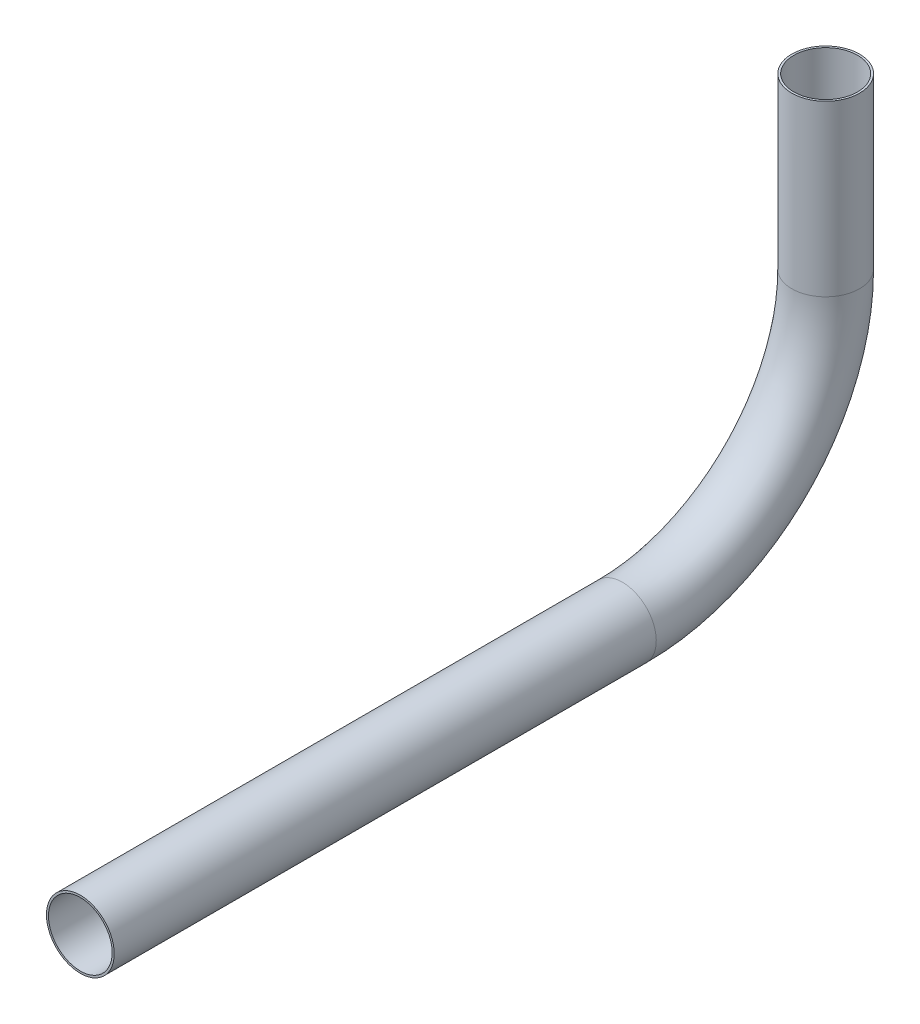
ISO-10303-21;
HEADER;
FILE_DESCRIPTION(('STEP AP214'),'2;1');
FILE_NAME('part.step','',(''),(''),'','','');
FILE_SCHEMA(('AUTOMOTIVE_DESIGN { 1 0 10303 214 1 1 1 1 }'));
ENDSEC;
DATA;
#1=APPLICATION_CONTEXT('core data for automotive mechanical design processes');
#2=APPLICATION_PROTOCOL_DEFINITION('international standard','automotive_design',2000,#1);
#3=PRODUCT_CONTEXT('',#1,'mechanical');
#4=PRODUCT('Part','Part','',(#3));
#5=PRODUCT_RELATED_PRODUCT_CATEGORY('part','',(#4));
#6=PRODUCT_DEFINITION_FORMATION('','',#4);
#7=PRODUCT_DEFINITION_CONTEXT('part definition',#1,'design');
#8=PRODUCT_DEFINITION('design','',#6,#7);
#9=PRODUCT_DEFINITION_SHAPE('','',#8);
#10=(LENGTH_UNIT() NAMED_UNIT(*) SI_UNIT(.MILLI.,.METRE.));
#11=(NAMED_UNIT(*) PLANE_ANGLE_UNIT() SI_UNIT($,.RADIAN.));
#12=(NAMED_UNIT(*) SI_UNIT($,.STERADIAN.) SOLID_ANGLE_UNIT());
#13=UNCERTAINTY_MEASURE_WITH_UNIT(LENGTH_MEASURE(1.E-05),#10,'distance_accuracy_value','');
#14=(GEOMETRIC_REPRESENTATION_CONTEXT(3) GLOBAL_UNCERTAINTY_ASSIGNED_CONTEXT((#13)) GLOBAL_UNIT_ASSIGNED_CONTEXT((#10,
#11,#12)) REPRESENTATION_CONTEXT('',''));
#15=CARTESIAN_POINT('',(0.,0.,0.));
#16=DIRECTION('',(0.,0.,1.));
#17=DIRECTION('',(1.,0.,0.));
#18=AXIS2_PLACEMENT_3D('',#15,#16,#17);
#19=CARTESIAN_POINT('',(0.,0.,0.));
#20=DIRECTION('',(0.,-1.,0.));
#21=DIRECTION('',(0.,0.,-1.));
#22=AXIS2_PLACEMENT_3D('',#19,#20,#21);
#23=CYLINDRICAL_SURFACE('',#22,6.35);
#24=CARTESIAN_POINT('',(0.,-31.75,0.));
#25=DIRECTION('',(0.,1.,0.));
#26=DIRECTION('',(0.,0.,1.));
#27=AXIS2_PLACEMENT_3D('',#24,#25,#26);
#28=CIRCLE('',#27,6.35);
#29=CARTESIAN_POINT('',(0.,-31.75,-6.34999999999999));
#30=VERTEX_POINT('',#29);
#31=EDGE_CURVE('E64',#30,#30,#28,.T.);
#32=ORIENTED_EDGE('',*,*,#31,.T.);
#33=EDGE_LOOP('',(#32));
#34=FACE_BOUND('',#33,.T.);
#35=CARTESIAN_POINT('',(0.,0.,0.));
#36=DIRECTION('',(0.,1.,0.));
#37=DIRECTION('',(0.,0.,1.));
#38=AXIS2_PLACEMENT_3D('',#35,#36,#37);
#39=CIRCLE('',#38,6.35);
#40=CARTESIAN_POINT('',(0.,0.,6.35));
#41=VERTEX_POINT('',#40);
#42=EDGE_CURVE('E61',#41,#41,#39,.T.);
#43=ORIENTED_EDGE('',*,*,#42,.F.);
#44=EDGE_LOOP('',(#43));
#45=FACE_BOUND('',#44,.T.);
#46=ADVANCED_FACE('F37',(#34,#45),#23,.T.);
#47=CARTESIAN_POINT('',(0.,-31.75,38.1));
#48=DIRECTION('',(-1.,0.,0.));
#49=DIRECTION('',(0.,0.,1.));
#50=AXIS2_PLACEMENT_3D('',#47,#48,#49);
#51=TOROIDAL_SURFACE('',#50,38.1,6.35);
#52=CARTESIAN_POINT('',(0.,-69.85,38.1));
#53=DIRECTION('',(0.,0.,-1.));
#54=DIRECTION('',(0.,1.,0.));
#55=AXIS2_PLACEMENT_3D('',#52,#53,#54);
#56=CIRCLE('',#55,6.35);
#57=CARTESIAN_POINT('',(0.,-76.2,38.1));
#58=VERTEX_POINT('',#57);
#59=EDGE_CURVE('E41',#58,#58,#56,.T.);
#60=CARTESIAN_POINT('',(0.,-31.75,38.1));
#61=DIRECTION('',(-1.,0.,0.));
#62=DIRECTION('',(0.,0.,1.));
#63=AXIS2_PLACEMENT_3D('',#60,#61,#62);
#64=CIRCLE('',#63,44.45);
#65=EDGE_CURVE('',#30,#58,#64,.T.);
#66=ORIENTED_EDGE('',*,*,#31,.F.);
#67=ORIENTED_EDGE('',*,*,#59,.T.);
#68=ORIENTED_EDGE('',*,*,#65,.T.);
#69=ORIENTED_EDGE('',*,*,#65,.F.);
#70=EDGE_LOOP('',(#66,#68,#67,#69));
#71=FACE_BOUND('',#70,.T.);
#72=ADVANCED_FACE('F73',(#71),#51,.T.);
#73=CARTESIAN_POINT('',(0.,-69.85,38.1));
#74=DIRECTION('',(0.,0.,1.));
#75=DIRECTION('',(0.,-1.,0.));
#76=AXIS2_PLACEMENT_3D('',#73,#74,#75);
#77=CYLINDRICAL_SURFACE('',#76,6.35);
#78=CARTESIAN_POINT('',(0.,-69.85,139.7));
#79=DIRECTION('',(0.,0.,-1.));
#80=DIRECTION('',(0.,1.,0.));
#81=AXIS2_PLACEMENT_3D('',#78,#79,#80);
#82=CIRCLE('',#81,6.35);
#83=CARTESIAN_POINT('',(0.,-63.5,139.7));
#84=VERTEX_POINT('',#83);
#85=EDGE_CURVE('E56',#84,#84,#82,.T.);
#86=ORIENTED_EDGE('',*,*,#85,.T.);
#87=EDGE_LOOP('',(#86));
#88=FACE_BOUND('',#87,.T.);
#89=ORIENTED_EDGE('',*,*,#59,.F.);
#90=EDGE_LOOP('',(#89));
#91=FACE_BOUND('',#90,.T.);
#92=ADVANCED_FACE('F39',(#88,#91),#77,.T.);
#93=CARTESIAN_POINT('',(0.,0.,0.));
#94=DIRECTION('',(0.,1.,0.));
#95=DIRECTION('',(0.,0.,1.));
#96=AXIS2_PLACEMENT_3D('',#93,#94,#95);
#97=PLANE('',#96);
#98=CARTESIAN_POINT('',(0.,0.,0.));
#99=DIRECTION('',(0.,1.,0.));
#100=DIRECTION('',(0.,0.,1.));
#101=AXIS2_PLACEMENT_3D('',#98,#99,#100);
#102=CIRCLE('',#101,5.969);
#103=CARTESIAN_POINT('',(0.,0.,5.969));
#104=VERTEX_POINT('',#103);
#105=EDGE_CURVE('E60',#104,#104,#102,.F.);
#106=ORIENTED_EDGE('',*,*,#105,.T.);
#107=EDGE_LOOP('',(#106));
#108=FACE_BOUND('',#107,.T.);
#109=ORIENTED_EDGE('',*,*,#42,.T.);
#110=EDGE_LOOP('',(#109));
#111=FACE_BOUND('',#110,.T.);
#112=ADVANCED_FACE('F77',(#108,#111),#97,.T.);
#113=CARTESIAN_POINT('',(0.,-69.85,139.7));
#114=DIRECTION('',(0.,0.,-1.));
#115=DIRECTION('',(0.,1.,0.));
#116=AXIS2_PLACEMENT_3D('',#113,#114,#115);
#117=PLANE('',#116);
#118=CARTESIAN_POINT('',(0.,-69.85,139.7));
#119=DIRECTION('',(0.,0.,-1.));
#120=DIRECTION('',(0.,1.,0.));
#121=AXIS2_PLACEMENT_3D('',#118,#119,#120);
#122=CIRCLE('',#121,5.969);
#123=CARTESIAN_POINT('',(0.,-63.881,139.7));
#124=VERTEX_POINT('',#123);
#125=EDGE_CURVE('E10',#124,#124,#122,.F.);
#126=ORIENTED_EDGE('',*,*,#125,.F.);
#127=EDGE_LOOP('',(#126));
#128=FACE_BOUND('',#127,.T.);
#129=ORIENTED_EDGE('',*,*,#85,.F.);
#130=EDGE_LOOP('',(#129));
#131=FACE_BOUND('',#130,.T.);
#132=ADVANCED_FACE('F83',(#128,#131),#117,.F.);
#133=CARTESIAN_POINT('',(0.,0.,0.));
#134=DIRECTION('',(0.,-1.,0.));
#135=DIRECTION('',(0.,0.,-1.));
#136=AXIS2_PLACEMENT_3D('',#133,#134,#135);
#137=CYLINDRICAL_SURFACE('',#136,5.969);
#138=CARTESIAN_POINT('',(0.,-31.75,0.));
#139=DIRECTION('',(0.,1.,0.));
#140=DIRECTION('',(0.,0.,1.));
#141=AXIS2_PLACEMENT_3D('',#138,#139,#140);
#142=CIRCLE('',#141,5.969);
#143=CARTESIAN_POINT('',(0.,-31.75,-5.96899999999999));
#144=VERTEX_POINT('',#143);
#145=EDGE_CURVE('E52',#144,#144,#142,.F.);
#146=ORIENTED_EDGE('',*,*,#145,.T.);
#147=EDGE_LOOP('',(#146));
#148=FACE_BOUND('',#147,.T.);
#149=ORIENTED_EDGE('',*,*,#105,.F.);
#150=EDGE_LOOP('',(#149));
#151=FACE_BOUND('',#150,.T.);
#152=ADVANCED_FACE('F93',(#148,#151),#137,.F.);
#153=CARTESIAN_POINT('',(0.,-31.75,38.1));
#154=DIRECTION('',(-1.,0.,0.));
#155=DIRECTION('',(0.,0.,1.));
#156=AXIS2_PLACEMENT_3D('',#153,#154,#155);
#157=TOROIDAL_SURFACE('',#156,38.1,5.969);
#158=CARTESIAN_POINT('',(0.,-69.85,38.1));
#159=DIRECTION('',(0.,0.,-1.));
#160=DIRECTION('',(0.,1.,0.));
#161=AXIS2_PLACEMENT_3D('',#158,#159,#160);
#162=CIRCLE('',#161,5.969);
#163=CARTESIAN_POINT('',(0.,-75.819,38.1));
#164=VERTEX_POINT('',#163);
#165=EDGE_CURVE('E46',#164,#164,#162,.F.);
#166=CARTESIAN_POINT('',(0.,-31.75,38.1));
#167=DIRECTION('',(-1.,0.,0.));
#168=DIRECTION('',(0.,0.,1.));
#169=AXIS2_PLACEMENT_3D('',#166,#167,#168);
#170=CIRCLE('',#169,44.069);
#171=EDGE_CURVE('',#144,#164,#170,.T.);
#172=ORIENTED_EDGE('',*,*,#145,.F.);
#173=ORIENTED_EDGE('',*,*,#165,.T.);
#174=ORIENTED_EDGE('',*,*,#171,.T.);
#175=ORIENTED_EDGE('',*,*,#171,.F.);
#176=EDGE_LOOP('',(#172,#174,#173,#175));
#177=FACE_BOUND('',#176,.T.);
#178=ADVANCED_FACE('F88',(#177),#157,.F.);
#179=CARTESIAN_POINT('',(0.,-69.85,38.1));
#180=DIRECTION('',(0.,0.,1.));
#181=DIRECTION('',(0.,-1.,0.));
#182=AXIS2_PLACEMENT_3D('',#179,#180,#181);
#183=CYLINDRICAL_SURFACE('',#182,5.969);
#184=ORIENTED_EDGE('',*,*,#125,.T.);
#185=EDGE_LOOP('',(#184));
#186=FACE_BOUND('',#185,.T.);
#187=ORIENTED_EDGE('',*,*,#165,.F.);
#188=EDGE_LOOP('',(#187));
#189=FACE_BOUND('',#188,.T.);
#190=ADVANCED_FACE('F86',(#186,#189),#183,.F.);
#191=CLOSED_SHELL('',(#46,#72,#92,#112,#132,#152,#178,#190));
#192=MANIFOLD_SOLID_BREP('B2',#191);
#193=ADVANCED_BREP_SHAPE_REPRESENTATION('',(#18,#192),#14);
#194=SHAPE_DEFINITION_REPRESENTATION(#9,#193);
ENDSEC;
END-ISO-10303-21;
